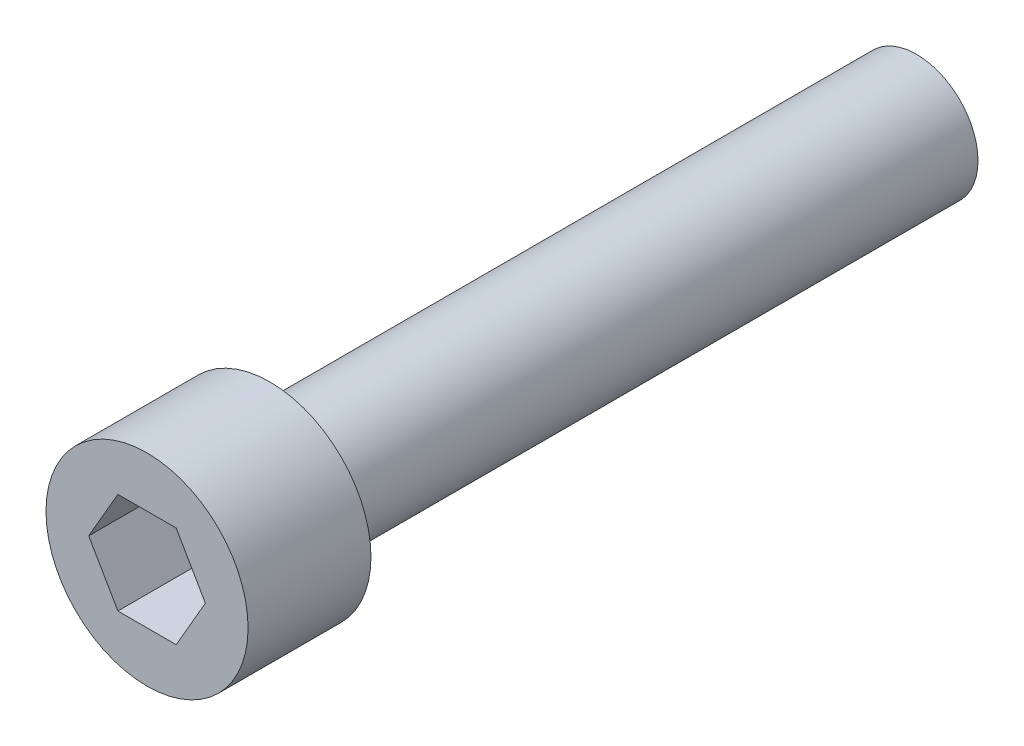
ISO-10303-21;
HEADER;
FILE_DESCRIPTION(('STEP AP214'),'2;1');
FILE_NAME('part.step','',(''),(''),'','','');
FILE_SCHEMA(('AUTOMOTIVE_DESIGN { 1 0 10303 214 1 1 1 1 }'));
ENDSEC;
DATA;
#1=APPLICATION_CONTEXT('core data for automotive mechanical design processes');
#2=APPLICATION_PROTOCOL_DEFINITION('international standard','automotive_design',2000,#1);
#3=PRODUCT_CONTEXT('',#1,'mechanical');
#4=PRODUCT('Part','Part','',(#3));
#5=PRODUCT_RELATED_PRODUCT_CATEGORY('part','',(#4));
#6=PRODUCT_DEFINITION_FORMATION('','',#4);
#7=PRODUCT_DEFINITION_CONTEXT('part definition',#1,'design');
#8=PRODUCT_DEFINITION('design','',#6,#7);
#9=PRODUCT_DEFINITION_SHAPE('','',#8);
#10=(LENGTH_UNIT() NAMED_UNIT(*) SI_UNIT(.MILLI.,.METRE.));
#11=(NAMED_UNIT(*) PLANE_ANGLE_UNIT() SI_UNIT($,.RADIAN.));
#12=(NAMED_UNIT(*) SI_UNIT($,.STERADIAN.) SOLID_ANGLE_UNIT());
#13=UNCERTAINTY_MEASURE_WITH_UNIT(LENGTH_MEASURE(1.E-05),#10,'distance_accuracy_value','');
#14=(GEOMETRIC_REPRESENTATION_CONTEXT(3) GLOBAL_UNCERTAINTY_ASSIGNED_CONTEXT((#13)) GLOBAL_UNIT_ASSIGNED_CONTEXT((#10,
#11,#12)) REPRESENTATION_CONTEXT('',''));
#15=CARTESIAN_POINT('',(0.,0.,0.));
#16=DIRECTION('',(0.,0.,1.));
#17=DIRECTION('',(1.,0.,0.));
#18=AXIS2_PLACEMENT_3D('',#15,#16,#17);
#19=CARTESIAN_POINT('',(0.,0.,25.4));
#20=DIRECTION('',(0.,0.,-1.));
#21=DIRECTION('',(-1.,0.,0.));
#22=AXIS2_PLACEMENT_3D('',#19,#20,#21);
#23=CYLINDRICAL_SURFACE('',#22,2.413);
#24=CARTESIAN_POINT('',(0.,0.,25.4));
#25=DIRECTION('',(0.,0.,1.));
#26=DIRECTION('',(1.,0.,0.));
#27=AXIS2_PLACEMENT_3D('',#24,#25,#26);
#28=CIRCLE('',#27,2.413);
#29=CARTESIAN_POINT('',(2.413,0.,25.4));
#30=VERTEX_POINT('',#29);
#31=EDGE_CURVE('E11',#30,#30,#28,.T.);
#32=ORIENTED_EDGE('',*,*,#31,.F.);
#33=EDGE_LOOP('',(#32));
#34=FACE_BOUND('',#33,.T.);
#35=CARTESIAN_POINT('',(0.,0.,0.));
#36=DIRECTION('',(0.,0.,1.));
#37=DIRECTION('',(1.,0.,0.));
#38=AXIS2_PLACEMENT_3D('',#35,#36,#37);
#39=CIRCLE('',#38,2.413);
#40=CARTESIAN_POINT('',(2.413,0.,0.));
#41=VERTEX_POINT('',#40);
#42=EDGE_CURVE('E36',#41,#41,#39,.T.);
#43=ORIENTED_EDGE('',*,*,#42,.T.);
#44=EDGE_LOOP('',(#43));
#45=FACE_BOUND('',#44,.T.);
#46=ADVANCED_FACE('F33',(#34,#45),#23,.T.);
#47=CARTESIAN_POINT('',(0.,0.,0.));
#48=DIRECTION('',(0.,0.,1.));
#49=DIRECTION('',(1.,0.,0.));
#50=AXIS2_PLACEMENT_3D('',#47,#48,#49);
#51=PLANE('',#50);
#52=ORIENTED_EDGE('',*,*,#42,.F.);
#53=EDGE_LOOP('',(#52));
#54=FACE_BOUND('',#53,.T.);
#55=ADVANCED_FACE('F151',(#54),#51,.F.);
#56=CARTESIAN_POINT('',(0.,0.,25.4));
#57=DIRECTION('',(0.,0.,1.));
#58=DIRECTION('',(1.,0.,0.));
#59=AXIS2_PLACEMENT_3D('',#56,#57,#58);
#60=PLANE('',#59);
#61=CARTESIAN_POINT('',(0.,0.,25.4));
#62=DIRECTION('',(0.,0.,1.));
#63=DIRECTION('',(1.,0.,0.));
#64=AXIS2_PLACEMENT_3D('',#61,#62,#63);
#65=CIRCLE('',#64,3.96875);
#66=CARTESIAN_POINT('',(3.96875,0.,25.4));
#67=VERTEX_POINT('',#66);
#68=EDGE_CURVE('E134',#67,#67,#65,.T.);
#69=ORIENTED_EDGE('',*,*,#68,.F.);
#70=EDGE_LOOP('',(#69));
#71=FACE_BOUND('',#70,.T.);
#72=ORIENTED_EDGE('',*,*,#31,.T.);
#73=EDGE_LOOP('',(#72));
#74=FACE_BOUND('',#73,.T.);
#75=ADVANCED_FACE('F148',(#71,#74),#60,.F.);
#76=CARTESIAN_POINT('',(0.,0.,30.226));
#77=DIRECTION('',(0.,0.,-1.));
#78=DIRECTION('',(-1.,0.,0.));
#79=AXIS2_PLACEMENT_3D('',#76,#77,#78);
#80=CYLINDRICAL_SURFACE('',#79,3.96875);
#81=CARTESIAN_POINT('',(0.,0.,30.226));
#82=DIRECTION('',(0.,0.,1.));
#83=DIRECTION('',(1.,0.,0.));
#84=AXIS2_PLACEMENT_3D('',#81,#82,#83);
#85=CIRCLE('',#84,3.96875);
#86=CARTESIAN_POINT('',(3.96875,0.,30.226));
#87=VERTEX_POINT('',#86);
#88=EDGE_CURVE('E140',#87,#87,#85,.T.);
#89=ORIENTED_EDGE('',*,*,#88,.F.);
#90=EDGE_LOOP('',(#89));
#91=FACE_BOUND('',#90,.T.);
#92=ORIENTED_EDGE('',*,*,#68,.T.);
#93=EDGE_LOOP('',(#92));
#94=FACE_BOUND('',#93,.T.);
#95=ADVANCED_FACE('F146',(#91,#94),#80,.T.);
#96=CARTESIAN_POINT('',(0.,0.,30.226));
#97=DIRECTION('',(0.,0.,1.));
#98=DIRECTION('',(1.,0.,0.));
#99=AXIS2_PLACEMENT_3D('',#96,#97,#98);
#100=PLANE('',#99);
#101=DIRECTION('',(0.5,0.866025403784439,0.));
#102=VECTOR('',#101,1.);
#103=CARTESIAN_POINT('',(1.14567944042316,-1.984375,30.226));
#104=LINE('',#103,#102);
#105=CARTESIAN_POINT('',(1.14567944042316,-1.984375,30.226));
#106=VERTEX_POINT('',#105);
#107=CARTESIAN_POINT('',(2.29135888084633,0.,30.226));
#108=VERTEX_POINT('',#107);
#109=EDGE_CURVE('E47',#106,#108,#104,.T.);
#110=ORIENTED_EDGE('',*,*,#109,.F.);
#111=DIRECTION('',(1.,0.,0.));
#112=VECTOR('',#111,1.);
#113=CARTESIAN_POINT('',(-1.14567944042316,-1.984375,30.226));
#114=LINE('',#113,#112);
#115=CARTESIAN_POINT('',(-1.14567944042316,-1.984375,30.226));
#116=VERTEX_POINT('',#115);
#117=EDGE_CURVE('E130',#116,#106,#114,.T.);
#118=ORIENTED_EDGE('',*,*,#117,.F.);
#119=DIRECTION('',(0.5,-0.866025403784439,0.));
#120=VECTOR('',#119,1.);
#121=CARTESIAN_POINT('',(-2.29135888084633,0.,30.226));
#122=LINE('',#121,#120);
#123=CARTESIAN_POINT('',(-2.29135888084633,0.,30.226));
#124=VERTEX_POINT('',#123);
#125=EDGE_CURVE('E128',#124,#116,#122,.T.);
#126=ORIENTED_EDGE('',*,*,#125,.F.);
#127=DIRECTION('',(-0.5,-0.866025403784439,0.));
#128=VECTOR('',#127,1.);
#129=CARTESIAN_POINT('',(-1.14567944042316,1.984375,30.226));
#130=LINE('',#129,#128);
#131=CARTESIAN_POINT('',(-1.14567944042316,1.984375,30.226));
#132=VERTEX_POINT('',#131);
#133=EDGE_CURVE('E95',#132,#124,#130,.T.);
#134=ORIENTED_EDGE('',*,*,#133,.F.);
#135=DIRECTION('',(-1.,0.,0.));
#136=VECTOR('',#135,1.);
#137=CARTESIAN_POINT('',(1.14567944042316,1.984375,30.226));
#138=LINE('',#137,#136);
#139=CARTESIAN_POINT('',(1.14567944042316,1.984375,30.226));
#140=VERTEX_POINT('',#139);
#141=EDGE_CURVE('E124',#140,#132,#138,.T.);
#142=ORIENTED_EDGE('',*,*,#141,.F.);
#143=DIRECTION('',(-0.5,0.866025403784438,0.));
#144=VECTOR('',#143,1.);
#145=CARTESIAN_POINT('',(2.29135888084633,0.,30.226));
#146=LINE('',#145,#144);
#147=EDGE_CURVE('E121',#108,#140,#146,.T.);
#148=ORIENTED_EDGE('',*,*,#147,.F.);
#149=EDGE_LOOP('',(#110,#118,#126,#134,#142,#148));
#150=FACE_BOUND('',#149,.T.);
#151=ORIENTED_EDGE('',*,*,#88,.T.);
#152=EDGE_LOOP('',(#151));
#153=FACE_BOUND('',#152,.T.);
#154=ADVANCED_FACE('F165',(#150,#153),#100,.T.);
#155=CARTESIAN_POINT('',(1.14567944042316,-1.984375,26.416));
#156=DIRECTION('',(0.866025403784439,-0.5,0.));
#157=DIRECTION('',(0.5,0.866025403784439,0.));
#158=AXIS2_PLACEMENT_3D('',#155,#156,#157);
#159=PLANE('',#158);
#160=ORIENTED_EDGE('',*,*,#109,.T.);
#161=DIRECTION('',(0.,0.,1.));
#162=VECTOR('',#161,1.);
#163=CARTESIAN_POINT('',(2.29135888084633,0.,26.416));
#164=LINE('',#163,#162);
#165=CARTESIAN_POINT('',(2.29135888084633,0.,26.416));
#166=VERTEX_POINT('',#165);
#167=EDGE_CURVE('E77',#166,#108,#164,.T.);
#168=ORIENTED_EDGE('',*,*,#167,.F.);
#169=DIRECTION('',(0.5,0.866025403784439,0.));
#170=VECTOR('',#169,1.);
#171=CARTESIAN_POINT('',(1.14567944042316,-1.984375,26.416));
#172=LINE('',#171,#170);
#173=CARTESIAN_POINT('',(1.14567944042316,-1.984375,26.416));
#174=VERTEX_POINT('',#173);
#175=EDGE_CURVE('E132',#174,#166,#172,.T.);
#176=ORIENTED_EDGE('',*,*,#175,.F.);
#177=DIRECTION('',(0.,0.,1.));
#178=VECTOR('',#177,1.);
#179=CARTESIAN_POINT('',(1.14567944042316,-1.984375,26.416));
#180=LINE('',#179,#178);
#181=EDGE_CURVE('E55',#174,#106,#180,.T.);
#182=ORIENTED_EDGE('',*,*,#181,.T.);
#183=EDGE_LOOP('',(#160,#168,#176,#182));
#184=FACE_BOUND('',#183,.T.);
#185=ADVANCED_FACE('F170',(#184),#159,.F.);
#186=CARTESIAN_POINT('',(-1.14567944042316,-1.984375,26.416));
#187=DIRECTION('',(0.,-1.,0.));
#188=DIRECTION('',(0.,0.,-1.));
#189=AXIS2_PLACEMENT_3D('',#186,#187,#188);
#190=PLANE('',#189);
#191=ORIENTED_EDGE('',*,*,#117,.T.);
#192=ORIENTED_EDGE('',*,*,#181,.F.);
#193=DIRECTION('',(1.,0.,0.));
#194=VECTOR('',#193,1.);
#195=CARTESIAN_POINT('',(-1.14567944042316,-1.984375,26.416));
#196=LINE('',#195,#194);
#197=CARTESIAN_POINT('',(-1.14567944042316,-1.984375,26.416));
#198=VERTEX_POINT('',#197);
#199=EDGE_CURVE('E107',#198,#174,#196,.T.);
#200=ORIENTED_EDGE('',*,*,#199,.F.);
#201=DIRECTION('',(0.,0.,1.));
#202=VECTOR('',#201,1.);
#203=CARTESIAN_POINT('',(-1.14567944042316,-1.984375,26.416));
#204=LINE('',#203,#202);
#205=EDGE_CURVE('E99',#198,#116,#204,.T.);
#206=ORIENTED_EDGE('',*,*,#205,.T.);
#207=EDGE_LOOP('',(#191,#192,#200,#206));
#208=FACE_BOUND('',#207,.T.);
#209=ADVANCED_FACE('F174',(#208),#190,.F.);
#210=CARTESIAN_POINT('',(-2.29135888084633,0.,26.416));
#211=DIRECTION('',(-0.866025403784439,-0.5,0.));
#212=DIRECTION('',(0.5,-0.866025403784439,0.));
#213=AXIS2_PLACEMENT_3D('',#210,#211,#212);
#214=PLANE('',#213);
#215=ORIENTED_EDGE('',*,*,#125,.T.);
#216=ORIENTED_EDGE('',*,*,#205,.F.);
#217=DIRECTION('',(0.5,-0.866025403784439,0.));
#218=VECTOR('',#217,1.);
#219=CARTESIAN_POINT('',(-2.29135888084633,0.,26.416));
#220=LINE('',#219,#218);
#221=CARTESIAN_POINT('',(-2.29135888084633,0.,26.416));
#222=VERTEX_POINT('',#221);
#223=EDGE_CURVE('E103',#222,#198,#220,.T.);
#224=ORIENTED_EDGE('',*,*,#223,.F.);
#225=DIRECTION('',(0.,0.,1.));
#226=VECTOR('',#225,1.);
#227=CARTESIAN_POINT('',(-2.29135888084633,0.,26.416));
#228=LINE('',#227,#226);
#229=EDGE_CURVE('E88',#222,#124,#228,.T.);
#230=ORIENTED_EDGE('',*,*,#229,.T.);
#231=EDGE_LOOP('',(#215,#216,#224,#230));
#232=FACE_BOUND('',#231,.T.);
#233=ADVANCED_FACE('F104',(#232),#214,.F.);
#234=CARTESIAN_POINT('',(-1.14567944042316,1.984375,26.416));
#235=DIRECTION('',(-0.866025403784439,0.5,0.));
#236=DIRECTION('',(-0.5,-0.866025403784439,0.));
#237=AXIS2_PLACEMENT_3D('',#234,#235,#236);
#238=PLANE('',#237);
#239=ORIENTED_EDGE('',*,*,#133,.T.);
#240=ORIENTED_EDGE('',*,*,#229,.F.);
#241=DIRECTION('',(-0.5,-0.866025403784439,0.));
#242=VECTOR('',#241,1.);
#243=CARTESIAN_POINT('',(-1.14567944042316,1.984375,26.416));
#244=LINE('',#243,#242);
#245=CARTESIAN_POINT('',(-1.14567944042316,1.984375,26.416));
#246=VERTEX_POINT('',#245);
#247=EDGE_CURVE('E92',#246,#222,#244,.T.);
#248=ORIENTED_EDGE('',*,*,#247,.F.);
#249=DIRECTION('',(0.,0.,1.));
#250=VECTOR('',#249,1.);
#251=CARTESIAN_POINT('',(-1.14567944042316,1.984375,26.416));
#252=LINE('',#251,#250);
#253=EDGE_CURVE('E100',#246,#132,#252,.T.);
#254=ORIENTED_EDGE('',*,*,#253,.T.);
#255=EDGE_LOOP('',(#239,#240,#248,#254));
#256=FACE_BOUND('',#255,.T.);
#257=ADVANCED_FACE('F90',(#256),#238,.F.);
#258=CARTESIAN_POINT('',(1.14567944042316,1.984375,26.416));
#259=DIRECTION('',(0.,1.,0.));
#260=DIRECTION('',(0.,0.,1.));
#261=AXIS2_PLACEMENT_3D('',#258,#259,#260);
#262=PLANE('',#261);
#263=ORIENTED_EDGE('',*,*,#141,.T.);
#264=ORIENTED_EDGE('',*,*,#253,.F.);
#265=DIRECTION('',(-1.,0.,0.));
#266=VECTOR('',#265,1.);
#267=CARTESIAN_POINT('',(1.14567944042316,1.984375,26.416));
#268=LINE('',#267,#266);
#269=CARTESIAN_POINT('',(1.14567944042316,1.984375,26.416));
#270=VERTEX_POINT('',#269);
#271=EDGE_CURVE('E113',#270,#246,#268,.T.);
#272=ORIENTED_EDGE('',*,*,#271,.F.);
#273=DIRECTION('',(0.,0.,1.));
#274=VECTOR('',#273,1.);
#275=CARTESIAN_POINT('',(1.14567944042316,1.984375,26.416));
#276=LINE('',#275,#274);
#277=EDGE_CURVE('E137',#270,#140,#276,.T.);
#278=ORIENTED_EDGE('',*,*,#277,.T.);
#279=EDGE_LOOP('',(#263,#264,#272,#278));
#280=FACE_BOUND('',#279,.T.);
#281=ADVANCED_FACE('F178',(#280),#262,.F.);
#282=CARTESIAN_POINT('',(2.29135888084633,0.,26.416));
#283=DIRECTION('',(0.866025403784438,0.5,0.));
#284=DIRECTION('',(-0.5,0.866025403784439,0.));
#285=AXIS2_PLACEMENT_3D('',#282,#283,#284);
#286=PLANE('',#285);
#287=ORIENTED_EDGE('',*,*,#147,.T.);
#288=ORIENTED_EDGE('',*,*,#277,.F.);
#289=DIRECTION('',(-0.5,0.866025403784438,0.));
#290=VECTOR('',#289,1.);
#291=CARTESIAN_POINT('',(2.29135888084633,0.,26.416));
#292=LINE('',#291,#290);
#293=EDGE_CURVE('E115',#166,#270,#292,.T.);
#294=ORIENTED_EDGE('',*,*,#293,.F.);
#295=ORIENTED_EDGE('',*,*,#167,.T.);
#296=EDGE_LOOP('',(#287,#288,#294,#295));
#297=FACE_BOUND('',#296,.T.);
#298=ADVANCED_FACE('F175',(#297),#286,.F.);
#299=CARTESIAN_POINT('',(0.,0.,26.416));
#300=DIRECTION('',(0.,0.,1.));
#301=DIRECTION('',(1.,0.,0.));
#302=AXIS2_PLACEMENT_3D('',#299,#300,#301);
#303=PLANE('',#302);
#304=ORIENTED_EDGE('',*,*,#175,.T.);
#305=ORIENTED_EDGE('',*,*,#293,.T.);
#306=ORIENTED_EDGE('',*,*,#271,.T.);
#307=ORIENTED_EDGE('',*,*,#247,.T.);
#308=ORIENTED_EDGE('',*,*,#223,.T.);
#309=ORIENTED_EDGE('',*,*,#199,.T.);
#310=EDGE_LOOP('',(#304,#305,#306,#307,#308,#309));
#311=FACE_BOUND('',#310,.T.);
#312=ADVANCED_FACE('F110',(#311),#303,.T.);
#313=CLOSED_SHELL('',(#46,#55,#75,#95,#154,#185,#209,#233,#257,#281,#298,#312));
#314=MANIFOLD_SOLID_BREP('B2',#313);
#315=ADVANCED_BREP_SHAPE_REPRESENTATION('',(#18,#314),#14);
#316=SHAPE_DEFINITION_REPRESENTATION(#9,#315);
ENDSEC;
END-ISO-10303-21;
